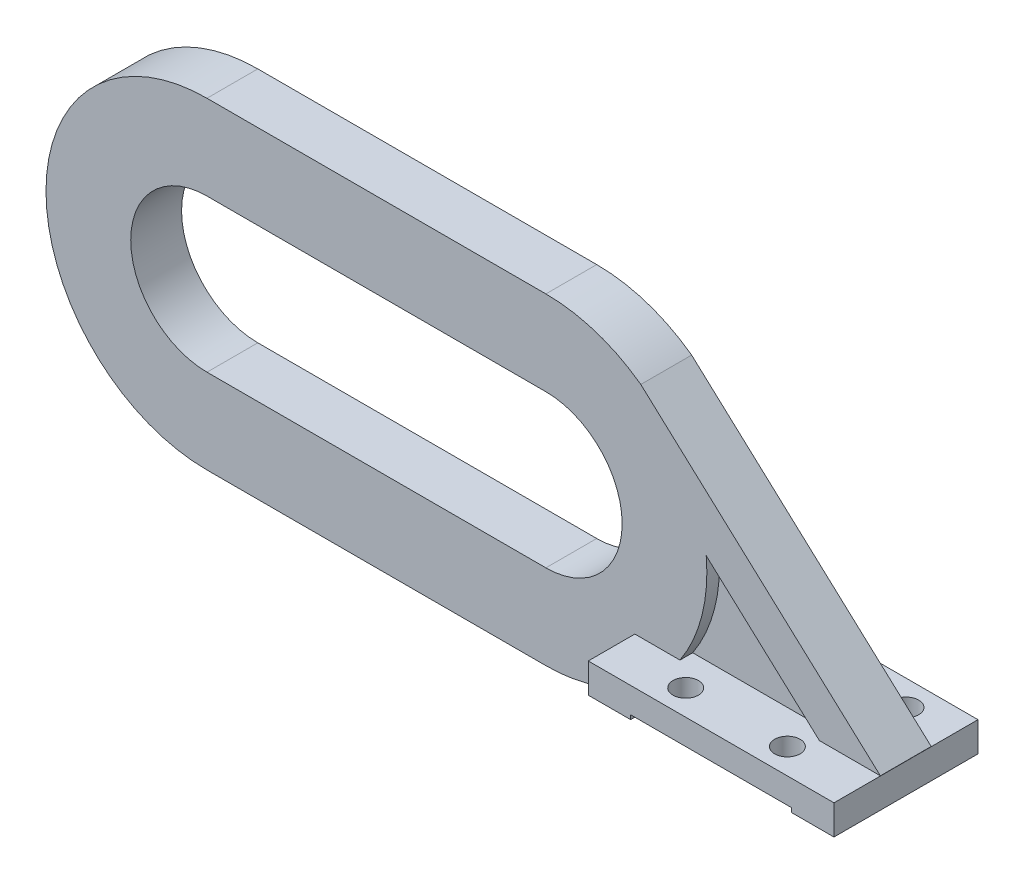
ISO-10303-21;
HEADER;
FILE_DESCRIPTION(('STEP AP214'),'2;1');
FILE_NAME('part.step','',(''),(''),'','','');
FILE_SCHEMA(('AUTOMOTIVE_DESIGN { 1 0 10303 214 1 1 1 1 }'));
ENDSEC;
DATA;
#1=APPLICATION_CONTEXT('core data for automotive mechanical design processes');
#2=APPLICATION_PROTOCOL_DEFINITION('international standard','automotive_design',2000,#1);
#3=PRODUCT_CONTEXT('',#1,'mechanical');
#4=PRODUCT('Part','Part','',(#3));
#5=PRODUCT_RELATED_PRODUCT_CATEGORY('part','',(#4));
#6=PRODUCT_DEFINITION_FORMATION('','',#4);
#7=PRODUCT_DEFINITION_CONTEXT('part definition',#1,'design');
#8=PRODUCT_DEFINITION('design','',#6,#7);
#9=PRODUCT_DEFINITION_SHAPE('','',#8);
#10=(LENGTH_UNIT() NAMED_UNIT(*) SI_UNIT(.MILLI.,.METRE.));
#11=(NAMED_UNIT(*) PLANE_ANGLE_UNIT() SI_UNIT($,.RADIAN.));
#12=(NAMED_UNIT(*) SI_UNIT($,.STERADIAN.) SOLID_ANGLE_UNIT());
#13=UNCERTAINTY_MEASURE_WITH_UNIT(LENGTH_MEASURE(1.E-05),#10,'distance_accuracy_value','');
#14=(GEOMETRIC_REPRESENTATION_CONTEXT(3) GLOBAL_UNCERTAINTY_ASSIGNED_CONTEXT((#13)) GLOBAL_UNIT_ASSIGNED_CONTEXT((#10,
#11,#12)) REPRESENTATION_CONTEXT('',''));
#15=CARTESIAN_POINT('',(0.,0.,0.));
#16=DIRECTION('',(0.,0.,1.));
#17=DIRECTION('',(1.,0.,0.));
#18=AXIS2_PLACEMENT_3D('',#15,#16,#17);
#19=CARTESIAN_POINT('',(-25.,13.5170465078334,3.));
#20=DIRECTION('',(0.,0.,-1.));
#21=DIRECTION('',(-1.,0.,0.));
#22=AXIS2_PLACEMENT_3D('',#19,#20,#21);
#23=CYLINDRICAL_SURFACE('',#22,19.);
#24=CARTESIAN_POINT('',(-25.,13.5170465078334,-1.5));
#25=DIRECTION('',(0.,0.,1.));
#26=DIRECTION('',(1.,0.,0.));
#27=AXIS2_PLACEMENT_3D('',#24,#25,#26);
#28=CIRCLE('',#27,19.);
#29=CARTESIAN_POINT('',(-9.17622887071258,3.,-1.5));
#30=VERTEX_POINT('',#29);
#31=CARTESIAN_POINT('',(-6.07646993535412,15.2199880489449,-1.5));
#32=VERTEX_POINT('',#31);
#33=EDGE_CURVE('E71',#30,#32,#28,.T.);
#34=ORIENTED_EDGE('',*,*,#33,.F.);
#35=DIRECTION('',(0.,0.,-1.));
#36=VECTOR('',#35,1.);
#37=CARTESIAN_POINT('',(-9.17622887071258,3.,3.));
#38=LINE('',#37,#36);
#39=CARTESIAN_POINT('',(-9.17622887071258,3.,-3.));
#40=VERTEX_POINT('',#39);
#41=EDGE_CURVE('E262',#30,#40,#38,.T.);
#42=ORIENTED_EDGE('',*,*,#41,.T.);
#43=CARTESIAN_POINT('',(-25.,13.5170465078334,-3.));
#44=DIRECTION('',(0.,0.,1.));
#45=DIRECTION('',(1.,0.,0.));
#46=AXIS2_PLACEMENT_3D('',#43,#44,#45);
#47=CIRCLE('',#46,19.);
#48=CARTESIAN_POINT('',(-6.07646993535412,15.2199880489449,-3.));
#49=VERTEX_POINT('',#48);
#50=EDGE_CURVE('E280',#40,#49,#47,.T.);
#51=ORIENTED_EDGE('',*,*,#50,.T.);
#52=DIRECTION('',(0.,0.,-1.));
#53=VECTOR('',#52,1.);
#54=CARTESIAN_POINT('',(-6.07646993535412,15.2199880489449,3.));
#55=LINE('',#54,#53);
#56=EDGE_CURVE('E263',#32,#49,#55,.T.);
#57=ORIENTED_EDGE('',*,*,#56,.F.);
#58=EDGE_LOOP('',(#34,#42,#51,#57));
#59=FACE_BOUND('',#58,.T.);
#60=ADVANCED_FACE('F47',(#59),#23,.T.);
#61=CARTESIAN_POINT('',(4.81172024055241,5.26029532035882,3.));
#62=DIRECTION('',(-0.674945472603317,-0.737867609407192,0.));
#63=DIRECTION('',(0.737867609407192,-0.674945472603317,0.));
#64=AXIS2_PLACEMENT_3D('',#61,#62,#63);
#65=PLANE('',#64);
#66=DIRECTION('',(0.,0.,-1.));
#67=VECTOR('',#66,1.);
#68=CARTESIAN_POINT('',(7.28273274791036,3.,3.));
#69=LINE('',#68,#67);
#70=CARTESIAN_POINT('',(7.28273274791036,3.,-1.5));
#71=VERTEX_POINT('',#70);
#72=CARTESIAN_POINT('',(7.28273274791036,3.,-3.));
#73=VERTEX_POINT('',#72);
#74=EDGE_CURVE('E430',#71,#73,#69,.T.);
#75=ORIENTED_EDGE('',*,*,#74,.F.);
#76=DIRECTION('',(-0.737867609407192,0.674945472603318,0.));
#77=VECTOR('',#76,1.);
#78=CARTESIAN_POINT('',(4.81172024055241,5.26029532035882,-1.5));
#79=LINE('',#78,#77);
#80=EDGE_CURVE('E271',#71,#32,#79,.T.);
#81=ORIENTED_EDGE('',*,*,#80,.T.);
#82=ORIENTED_EDGE('',*,*,#56,.T.);
#83=DIRECTION('',(-0.737867609407192,0.674945472603318,0.));
#84=VECTOR('',#83,1.);
#85=CARTESIAN_POINT('',(4.81172024055241,5.26029532035882,-3.));
#86=LINE('',#85,#84);
#87=EDGE_CURVE('E346',#73,#49,#86,.T.);
#88=ORIENTED_EDGE('',*,*,#87,.F.);
#89=EDGE_LOOP('',(#75,#81,#82,#88));
#90=FACE_BOUND('',#89,.T.);
#91=ADVANCED_FACE('F660',(#90),#65,.T.);
#92=CARTESIAN_POINT('',(-14.5,3.,0.));
#93=DIRECTION('',(1.,0.,0.));
#94=DIRECTION('',(0.,0.,-1.));
#95=AXIS2_PLACEMENT_3D('',#92,#93,#94);
#96=PLANE('',#95);
#97=DIRECTION('',(0.,-1.,0.));
#98=VECTOR('',#97,1.);
#99=CARTESIAN_POINT('',(-14.5,0.,-3.));
#100=LINE('',#99,#98);
#101=CARTESIAN_POINT('',(-14.5,3.,-3.));
#102=VERTEX_POINT('',#101);
#103=CARTESIAN_POINT('',(-14.5,-0.5,-3.));
#104=VERTEX_POINT('',#103);
#105=EDGE_CURVE('E372',#102,#104,#100,.T.);
#106=ORIENTED_EDGE('',*,*,#105,.F.);
#107=DIRECTION('',(0.,0.,1.));
#108=VECTOR('',#107,1.);
#109=CARTESIAN_POINT('',(-14.5,3.,0.));
#110=LINE('',#109,#108);
#111=CARTESIAN_POINT('',(-14.5,3.,-8.5));
#112=VERTEX_POINT('',#111);
#113=EDGE_CURVE('E548',#112,#102,#110,.T.);
#114=ORIENTED_EDGE('',*,*,#113,.F.);
#115=DIRECTION('',(0.,-1.,0.));
#116=VECTOR('',#115,1.);
#117=CARTESIAN_POINT('',(-14.5,3.,-8.5));
#118=LINE('',#117,#116);
#119=CARTESIAN_POINT('',(-14.5,-0.5,-8.5));
#120=VERTEX_POINT('',#119);
#121=EDGE_CURVE('E584',#112,#120,#118,.T.);
#122=ORIENTED_EDGE('',*,*,#121,.T.);
#123=DIRECTION('',(0.,0.,1.));
#124=VECTOR('',#123,1.);
#125=CARTESIAN_POINT('',(-14.5,-0.5,0.));
#126=LINE('',#125,#124);
#127=EDGE_CURVE('E483',#120,#104,#126,.T.);
#128=ORIENTED_EDGE('',*,*,#127,.T.);
#129=EDGE_LOOP('',(#106,#114,#122,#128));
#130=FACE_BOUND('',#129,.T.);
#131=ADVANCED_FACE('F671',(#130),#96,.F.);
#132=CARTESIAN_POINT('',(0.,-0.5,7.5));
#133=DIRECTION('',(0.,0.,1.));
#134=DIRECTION('',(1.,0.,0.));
#135=AXIS2_PLACEMENT_3D('',#132,#133,#134);
#136=PLANE('',#135);
#137=DIRECTION('',(1.,0.,0.));
#138=VECTOR('',#137,1.);
#139=CARTESIAN_POINT('',(0.,-0.5,7.5));
#140=LINE('',#139,#138);
#141=CARTESIAN_POINT('',(9.5,-0.5,7.5));
#142=VERTEX_POINT('',#141);
#143=CARTESIAN_POINT('',(13.5,-0.5,7.5));
#144=VERTEX_POINT('',#143);
#145=EDGE_CURVE('E470',#142,#144,#140,.T.);
#146=ORIENTED_EDGE('',*,*,#145,.F.);
#147=DIRECTION('',(0.,1.,0.));
#148=VECTOR('',#147,1.);
#149=CARTESIAN_POINT('',(9.5,-0.5,7.5));
#150=LINE('',#149,#148);
#151=CARTESIAN_POINT('',(9.5,0.,7.5));
#152=VERTEX_POINT('',#151);
#153=EDGE_CURVE('E456',#142,#152,#150,.T.);
#154=ORIENTED_EDGE('',*,*,#153,.T.);
#155=DIRECTION('',(1.,0.,0.));
#156=VECTOR('',#155,1.);
#157=CARTESIAN_POINT('',(0.,0.,7.5));
#158=LINE('',#157,#156);
#159=CARTESIAN_POINT('',(13.5,0.,7.5));
#160=VERTEX_POINT('',#159);
#161=EDGE_CURVE('E505',#152,#160,#158,.T.);
#162=ORIENTED_EDGE('',*,*,#161,.T.);
#163=DIRECTION('',(0.,1.,0.));
#164=VECTOR('',#163,1.);
#165=CARTESIAN_POINT('',(13.5,-0.5,7.5));
#166=LINE('',#165,#164);
#167=EDGE_CURVE('E520',#144,#160,#166,.T.);
#168=ORIENTED_EDGE('',*,*,#167,.F.);
#169=EDGE_LOOP('',(#146,#154,#162,#168));
#170=FACE_BOUND('',#169,.T.);
#171=ADVANCED_FACE('F687',(#170),#136,.F.);
#172=CARTESIAN_POINT('',(0.,3.,-8.5));
#173=DIRECTION('',(0.,0.,-1.));
#174=DIRECTION('',(-1.,0.,0.));
#175=AXIS2_PLACEMENT_3D('',#172,#173,#174);
#176=PLANE('',#175);
#177=DIRECTION('',(0.,-1.,0.));
#178=VECTOR('',#177,1.);
#179=CARTESIAN_POINT('',(14.5,3.,-8.5));
#180=LINE('',#179,#178);
#181=CARTESIAN_POINT('',(14.5,3.,-8.5));
#182=VERTEX_POINT('',#181);
#183=CARTESIAN_POINT('',(14.5,-0.5,-8.5));
#184=VERTEX_POINT('',#183);
#185=EDGE_CURVE('E559',#182,#184,#180,.T.);
#186=ORIENTED_EDGE('',*,*,#185,.T.);
#187=DIRECTION('',(1.,0.,0.));
#188=VECTOR('',#187,1.);
#189=CARTESIAN_POINT('',(0.,-0.5,-8.5));
#190=LINE('',#189,#188);
#191=EDGE_CURVE('E478',#120,#184,#190,.T.);
#192=ORIENTED_EDGE('',*,*,#191,.F.);
#193=ORIENTED_EDGE('',*,*,#121,.F.);
#194=DIRECTION('',(1.,0.,0.));
#195=VECTOR('',#194,1.);
#196=CARTESIAN_POINT('',(0.,3.,-8.5));
#197=LINE('',#196,#195);
#198=EDGE_CURVE('E543',#112,#182,#197,.T.);
#199=ORIENTED_EDGE('',*,*,#198,.T.);
#200=EDGE_LOOP('',(#186,#192,#193,#199));
#201=FACE_BOUND('',#200,.T.);
#202=ADVANCED_FACE('F675',(#201),#176,.T.);
#203=CARTESIAN_POINT('',(-14.5,3.,3.));
#204=VERTEX_POINT('',#203);
#205=CARTESIAN_POINT('',(-14.5,3.,8.5));
#206=VERTEX_POINT('',#205);
#207=EDGE_CURVE('E547',#204,#206,#110,.T.);
#208=ORIENTED_EDGE('',*,*,#207,.F.);
#209=DIRECTION('',(0.,-1.,0.));
#210=VECTOR('',#209,1.);
#211=CARTESIAN_POINT('',(-14.5,0.,3.));
#212=LINE('',#211,#210);
#213=CARTESIAN_POINT('',(-14.5,-0.5,3.));
#214=VERTEX_POINT('',#213);
#215=EDGE_CURVE('E322',#204,#214,#212,.T.);
#216=ORIENTED_EDGE('',*,*,#215,.T.);
#217=CARTESIAN_POINT('',(-14.5,-0.5,8.5));
#218=VERTEX_POINT('',#217);
#219=EDGE_CURVE('E482',#214,#218,#126,.T.);
#220=ORIENTED_EDGE('',*,*,#219,.T.);
#221=DIRECTION('',(0.,-1.,0.));
#222=VECTOR('',#221,1.);
#223=CARTESIAN_POINT('',(-14.5,3.,8.5));
#224=LINE('',#223,#222);
#225=EDGE_CURVE('E580',#206,#218,#224,.T.);
#226=ORIENTED_EDGE('',*,*,#225,.F.);
#227=EDGE_LOOP('',(#208,#216,#220,#226));
#228=FACE_BOUND('',#227,.T.);
#229=ADVANCED_FACE('F603',(#228),#96,.F.);
#230=CARTESIAN_POINT('',(0.,3.,8.5));
#231=DIRECTION('',(0.,0.,-1.));
#232=DIRECTION('',(-1.,0.,0.));
#233=AXIS2_PLACEMENT_3D('',#230,#231,#232);
#234=PLANE('',#233);
#235=DIRECTION('',(-1.,0.,0.));
#236=VECTOR('',#235,1.);
#237=CARTESIAN_POINT('',(-9.5,0.,8.5));
#238=LINE('',#237,#236);
#239=CARTESIAN_POINT('',(9.5,0.,8.5));
#240=VERTEX_POINT('',#239);
#241=CARTESIAN_POINT('',(-9.5,0.,8.5));
#242=VERTEX_POINT('',#241);
#243=EDGE_CURVE('E439',#240,#242,#238,.T.);
#244=ORIENTED_EDGE('',*,*,#243,.F.);
#245=DIRECTION('',(0.,1.,0.));
#246=VECTOR('',#245,1.);
#247=CARTESIAN_POINT('',(9.5,0.,8.5));
#248=LINE('',#247,#246);
#249=CARTESIAN_POINT('',(9.5,-0.5,8.5));
#250=VERTEX_POINT('',#249);
#251=EDGE_CURVE('E404',#250,#240,#248,.T.);
#252=ORIENTED_EDGE('',*,*,#251,.F.);
#253=DIRECTION('',(1.,0.,0.));
#254=VECTOR('',#253,1.);
#255=CARTESIAN_POINT('',(0.,-0.5,8.5));
#256=LINE('',#255,#254);
#257=CARTESIAN_POINT('',(14.5,-0.5,8.5));
#258=VERTEX_POINT('',#257);
#259=EDGE_CURVE('E487',#250,#258,#256,.T.);
#260=ORIENTED_EDGE('',*,*,#259,.T.);
#261=DIRECTION('',(0.,-1.,0.));
#262=VECTOR('',#261,1.);
#263=CARTESIAN_POINT('',(14.5,3.,8.5));
#264=LINE('',#263,#262);
#265=CARTESIAN_POINT('',(14.5,3.,8.5));
#266=VERTEX_POINT('',#265);
#267=EDGE_CURVE('E576',#266,#258,#264,.T.);
#268=ORIENTED_EDGE('',*,*,#267,.F.);
#269=DIRECTION('',(1.,0.,0.));
#270=VECTOR('',#269,1.);
#271=CARTESIAN_POINT('',(0.,3.,8.5));
#272=LINE('',#271,#270);
#273=EDGE_CURVE('E552',#206,#266,#272,.T.);
#274=ORIENTED_EDGE('',*,*,#273,.F.);
#275=ORIENTED_EDGE('',*,*,#225,.T.);
#276=CARTESIAN_POINT('',(-9.5,-0.5,8.5));
#277=VERTEX_POINT('',#276);
#278=EDGE_CURVE('E489',#218,#277,#256,.T.);
#279=ORIENTED_EDGE('',*,*,#278,.T.);
#280=DIRECTION('',(0.,-1.,0.));
#281=VECTOR('',#280,1.);
#282=CARTESIAN_POINT('',(-9.5,0.,8.5));
#283=LINE('',#282,#281);
#284=EDGE_CURVE('E443',#242,#277,#283,.T.);
#285=ORIENTED_EDGE('',*,*,#284,.F.);
#286=EDGE_LOOP('',(#244,#252,#260,#268,#274,#275,#279,#285));
#287=FACE_BOUND('',#286,.T.);
#288=ADVANCED_FACE('F597',(#287),#234,.F.);
#289=CARTESIAN_POINT('',(-9.00000000000001,3.,-5.5));
#290=DIRECTION('',(0.,-1.,0.));
#291=DIRECTION('',(0.,0.,-1.));
#292=AXIS2_PLACEMENT_3D('',#289,#290,#291);
#293=CYLINDRICAL_SURFACE('',#292,1.5);
#294=CARTESIAN_POINT('',(-9.00000000000001,3.,-5.5));
#295=DIRECTION('',(0.,1.,0.));
#296=DIRECTION('',(0.,0.,1.));
#297=AXIS2_PLACEMENT_3D('',#294,#295,#296);
#298=CIRCLE('',#297,1.5);
#299=CARTESIAN_POINT('',(-9.00000000000001,3.,-4.));
#300=VERTEX_POINT('',#299);
#301=EDGE_CURVE('E539',#300,#300,#298,.T.);
#302=ORIENTED_EDGE('',*,*,#301,.T.);
#303=EDGE_LOOP('',(#302));
#304=FACE_BOUND('',#303,.T.);
#305=CARTESIAN_POINT('',(-9.00000000000001,0.,-5.5));
#306=DIRECTION('',(0.,1.,0.));
#307=DIRECTION('',(0.,0.,1.));
#308=AXIS2_PLACEMENT_3D('',#305,#306,#307);
#309=CIRCLE('',#308,1.5);
#310=CARTESIAN_POINT('',(-9.00000000000001,0.,-4.));
#311=VERTEX_POINT('',#310);
#312=EDGE_CURVE('E531',#311,#311,#309,.T.);
#313=ORIENTED_EDGE('',*,*,#312,.F.);
#314=EDGE_LOOP('',(#313));
#315=FACE_BOUND('',#314,.T.);
#316=ADVANCED_FACE('F998',(#304,#315),#293,.F.);
#317=CARTESIAN_POINT('',(8.99999999999999,3.,-5.5));
#318=DIRECTION('',(0.,-1.,0.));
#319=DIRECTION('',(0.,0.,-1.));
#320=AXIS2_PLACEMENT_3D('',#317,#318,#319);
#321=CYLINDRICAL_SURFACE('',#320,1.5);
#322=CARTESIAN_POINT('',(8.99999999999999,3.,-5.5));
#323=DIRECTION('',(0.,1.,0.));
#324=DIRECTION('',(0.,0.,1.));
#325=AXIS2_PLACEMENT_3D('',#322,#323,#324);
#326=CIRCLE('',#325,1.5);
#327=CARTESIAN_POINT('',(8.99999999999999,3.,-4.));
#328=VERTEX_POINT('',#327);
#329=EDGE_CURVE('E535',#328,#328,#326,.T.);
#330=ORIENTED_EDGE('',*,*,#329,.T.);
#331=EDGE_LOOP('',(#330));
#332=FACE_BOUND('',#331,.T.);
#333=CARTESIAN_POINT('',(8.99999999999999,0.,-5.5));
#334=DIRECTION('',(0.,1.,0.));
#335=DIRECTION('',(0.,0.,1.));
#336=AXIS2_PLACEMENT_3D('',#333,#334,#335);
#337=CIRCLE('',#336,1.5);
#338=CARTESIAN_POINT('',(8.99999999999999,0.,-4.));
#339=VERTEX_POINT('',#338);
#340=EDGE_CURVE('E567',#339,#339,#337,.T.);
#341=ORIENTED_EDGE('',*,*,#340,.F.);
#342=EDGE_LOOP('',(#341));
#343=FACE_BOUND('',#342,.T.);
#344=ADVANCED_FACE('F1073',(#332,#343),#321,.F.);
#345=CARTESIAN_POINT('',(-6.,3.,5.5));
#346=DIRECTION('',(0.,-1.,0.));
#347=DIRECTION('',(0.,0.,-1.));
#348=AXIS2_PLACEMENT_3D('',#345,#346,#347);
#349=CYLINDRICAL_SURFACE('',#348,1.5);
#350=CARTESIAN_POINT('',(-6.,3.,5.5));
#351=DIRECTION('',(0.,1.,0.));
#352=DIRECTION('',(0.,0.,1.));
#353=AXIS2_PLACEMENT_3D('',#350,#351,#352);
#354=CIRCLE('',#353,1.5);
#355=CARTESIAN_POINT('',(-6.,3.,7.));
#356=VERTEX_POINT('',#355);
#357=EDGE_CURVE('E530',#356,#356,#354,.T.);
#358=ORIENTED_EDGE('',*,*,#357,.T.);
#359=EDGE_LOOP('',(#358));
#360=FACE_BOUND('',#359,.T.);
#361=CARTESIAN_POINT('',(-6.,0.,5.5));
#362=DIRECTION('',(0.,1.,0.));
#363=DIRECTION('',(0.,0.,1.));
#364=AXIS2_PLACEMENT_3D('',#361,#362,#363);
#365=CIRCLE('',#364,1.5);
#366=CARTESIAN_POINT('',(-6.,0.,7.));
#367=VERTEX_POINT('',#366);
#368=EDGE_CURVE('E563',#367,#367,#365,.T.);
#369=ORIENTED_EDGE('',*,*,#368,.F.);
#370=EDGE_LOOP('',(#369));
#371=FACE_BOUND('',#370,.T.);
#372=ADVANCED_FACE('F1062',(#360,#371),#349,.F.);
#373=CARTESIAN_POINT('',(6.,3.,5.5));
#374=DIRECTION('',(0.,-1.,0.));
#375=DIRECTION('',(0.,0.,-1.));
#376=AXIS2_PLACEMENT_3D('',#373,#374,#375);
#377=CYLINDRICAL_SURFACE('',#376,1.5);
#378=CARTESIAN_POINT('',(6.,3.,5.5));
#379=DIRECTION('',(0.,1.,0.));
#380=DIRECTION('',(0.,0.,1.));
#381=AXIS2_PLACEMENT_3D('',#378,#379,#380);
#382=CIRCLE('',#381,1.5);
#383=CARTESIAN_POINT('',(6.,3.,7.));
#384=VERTEX_POINT('',#383);
#385=EDGE_CURVE('E526',#384,#384,#382,.T.);
#386=ORIENTED_EDGE('',*,*,#385,.T.);
#387=EDGE_LOOP('',(#386));
#388=FACE_BOUND('',#387,.T.);
#389=CARTESIAN_POINT('',(6.,0.,5.5));
#390=DIRECTION('',(0.,1.,0.));
#391=DIRECTION('',(0.,0.,1.));
#392=AXIS2_PLACEMENT_3D('',#389,#390,#391);
#393=CIRCLE('',#392,1.5);
#394=CARTESIAN_POINT('',(6.,0.,7.));
#395=VERTEX_POINT('',#394);
#396=EDGE_CURVE('E515',#395,#395,#393,.T.);
#397=ORIENTED_EDGE('',*,*,#396,.F.);
#398=EDGE_LOOP('',(#397));
#399=FACE_BOUND('',#398,.T.);
#400=ADVANCED_FACE('F49',(#388,#399),#377,.F.);
#401=CARTESIAN_POINT('',(14.5,3.,0.));
#402=DIRECTION('',(1.,0.,0.));
#403=DIRECTION('',(0.,0.,-1.));
#404=AXIS2_PLACEMENT_3D('',#401,#402,#403);
#405=PLANE('',#404);
#406=ORIENTED_EDGE('',*,*,#267,.T.);
#407=DIRECTION('',(0.,0.,1.));
#408=VECTOR('',#407,1.);
#409=CARTESIAN_POINT('',(14.5,-0.5,0.));
#410=LINE('',#409,#408);
#411=EDGE_CURVE('E493',#184,#258,#410,.T.);
#412=ORIENTED_EDGE('',*,*,#411,.F.);
#413=ORIENTED_EDGE('',*,*,#185,.F.);
#414=DIRECTION('',(0.,0.,1.));
#415=VECTOR('',#414,1.);
#416=CARTESIAN_POINT('',(14.5,3.,0.));
#417=LINE('',#416,#415);
#418=EDGE_CURVE('E555',#182,#266,#417,.T.);
#419=ORIENTED_EDGE('',*,*,#418,.T.);
#420=EDGE_LOOP('',(#406,#412,#413,#419));
#421=FACE_BOUND('',#420,.T.);
#422=ADVANCED_FACE('F677',(#421),#405,.T.);
#423=CARTESIAN_POINT('',(0.,3.,0.));
#424=DIRECTION('',(0.,1.,0.));
#425=DIRECTION('',(0.,0.,1.));
#426=AXIS2_PLACEMENT_3D('',#423,#424,#425);
#427=PLANE('',#426);
#428=DIRECTION('',(1.,0.,0.));
#429=VECTOR('',#428,1.);
#430=CARTESIAN_POINT('',(0.,3.,1.5));
#431=LINE('',#430,#429);
#432=CARTESIAN_POINT('',(-9.17622887071258,3.,1.5));
#433=VERTEX_POINT('',#432);
#434=CARTESIAN_POINT('',(7.28273274791036,3.,1.5));
#435=VERTEX_POINT('',#434);
#436=EDGE_CURVE('E63',#433,#435,#431,.T.);
#437=ORIENTED_EDGE('',*,*,#436,.F.);
#438=CARTESIAN_POINT('',(-9.17622887071258,3.,3.));
#439=VERTEX_POINT('',#438);
#440=EDGE_CURVE('E268',#439,#433,#38,.T.);
#441=ORIENTED_EDGE('',*,*,#440,.F.);
#442=DIRECTION('',(1.,0.,0.));
#443=VECTOR('',#442,1.);
#444=CARTESIAN_POINT('',(0.,3.,3.));
#445=LINE('',#444,#443);
#446=EDGE_CURVE('E292',#204,#439,#445,.T.);
#447=ORIENTED_EDGE('',*,*,#446,.F.);
#448=ORIENTED_EDGE('',*,*,#207,.T.);
#449=ORIENTED_EDGE('',*,*,#273,.T.);
#450=ORIENTED_EDGE('',*,*,#418,.F.);
#451=ORIENTED_EDGE('',*,*,#198,.F.);
#452=ORIENTED_EDGE('',*,*,#113,.T.);
#453=DIRECTION('',(1.,0.,0.));
#454=VECTOR('',#453,1.);
#455=CARTESIAN_POINT('',(0.,3.,-3.));
#456=LINE('',#455,#454);
#457=EDGE_CURVE('E275',#102,#40,#456,.T.);
#458=ORIENTED_EDGE('',*,*,#457,.T.);
#459=ORIENTED_EDGE('',*,*,#41,.F.);
#460=DIRECTION('',(1.,0.,0.));
#461=VECTOR('',#460,1.);
#462=CARTESIAN_POINT('',(0.,3.,-1.5));
#463=LINE('',#462,#461);
#464=EDGE_CURVE('E286',#30,#71,#463,.T.);
#465=ORIENTED_EDGE('',*,*,#464,.T.);
#466=ORIENTED_EDGE('',*,*,#74,.T.);
#467=DIRECTION('',(1.,0.,0.));
#468=VECTOR('',#467,1.);
#469=CARTESIAN_POINT('',(0.,3.,-3.));
#470=LINE('',#469,#468);
#471=CARTESIAN_POINT('',(14.476431662807,3.,-3.));
#472=VERTEX_POINT('',#471);
#473=EDGE_CURVE('E350',#73,#472,#470,.T.);
#474=ORIENTED_EDGE('',*,*,#473,.T.);
#475=DIRECTION('',(0.,0.,-1.));
#476=VECTOR('',#475,1.);
#477=CARTESIAN_POINT('',(14.476431662807,3.,3.));
#478=LINE('',#477,#476);
#479=CARTESIAN_POINT('',(14.476431662807,3.,3.));
#480=VERTEX_POINT('',#479);
#481=EDGE_CURVE('E426',#480,#472,#478,.T.);
#482=ORIENTED_EDGE('',*,*,#481,.F.);
#483=DIRECTION('',(1.,0.,0.));
#484=VECTOR('',#483,1.);
#485=CARTESIAN_POINT('',(0.,3.,3.));
#486=LINE('',#485,#484);
#487=CARTESIAN_POINT('',(7.28273274791036,3.,3.));
#488=VERTEX_POINT('',#487);
#489=EDGE_CURVE('E302',#488,#480,#486,.T.);
#490=ORIENTED_EDGE('',*,*,#489,.F.);
#491=EDGE_CURVE('E431',#488,#435,#69,.T.);
#492=ORIENTED_EDGE('',*,*,#491,.T.);
#493=EDGE_LOOP('',(#437,#441,#447,#448,#449,#450,#451,#452,#458,#459,#465,#466,#474,#482,#490,#492));
#494=FACE_BOUND('',#493,.T.);
#495=ORIENTED_EDGE('',*,*,#385,.F.);
#496=EDGE_LOOP('',(#495));
#497=FACE_BOUND('',#496,.T.);
#498=ORIENTED_EDGE('',*,*,#357,.F.);
#499=EDGE_LOOP('',(#498));
#500=FACE_BOUND('',#499,.T.);
#501=ORIENTED_EDGE('',*,*,#329,.F.);
#502=EDGE_LOOP('',(#501));
#503=FACE_BOUND('',#502,.T.);
#504=ORIENTED_EDGE('',*,*,#301,.F.);
#505=EDGE_LOOP('',(#504));
#506=FACE_BOUND('',#505,.T.);
#507=ADVANCED_FACE('F665',(#494,#497,#500,#503,#506),#427,.T.);
#508=CARTESIAN_POINT('',(0.,0.,0.));
#509=DIRECTION('',(0.,1.,0.));
#510=DIRECTION('',(0.,0.,1.));
#511=AXIS2_PLACEMENT_3D('',#508,#509,#510);
#512=PLANE('',#511);
#513=DIRECTION('',(0.,0.,1.));
#514=VECTOR('',#513,1.);
#515=CARTESIAN_POINT('',(-9.5,0.,2.5));
#516=LINE('',#515,#514);
#517=CARTESIAN_POINT('',(-9.5,0.,7.5));
#518=VERTEX_POINT('',#517);
#519=EDGE_CURVE('E447',#518,#242,#516,.T.);
#520=ORIENTED_EDGE('',*,*,#519,.F.);
#521=CARTESIAN_POINT('',(-13.5,0.,7.5));
#522=VERTEX_POINT('',#521);
#523=EDGE_CURVE('E506',#522,#518,#158,.T.);
#524=ORIENTED_EDGE('',*,*,#523,.F.);
#525=DIRECTION('',(0.,0.,1.));
#526=VECTOR('',#525,1.);
#527=CARTESIAN_POINT('',(-13.5,0.,0.));
#528=LINE('',#527,#526);
#529=CARTESIAN_POINT('',(-13.5,0.,-7.5));
#530=VERTEX_POINT('',#529);
#531=EDGE_CURVE('E466',#530,#522,#528,.T.);
#532=ORIENTED_EDGE('',*,*,#531,.F.);
#533=DIRECTION('',(1.,0.,0.));
#534=VECTOR('',#533,1.);
#535=CARTESIAN_POINT('',(0.,0.,-7.5));
#536=LINE('',#535,#534);
#537=CARTESIAN_POINT('',(13.5,0.,-7.5));
#538=VERTEX_POINT('',#537);
#539=EDGE_CURVE('E460',#530,#538,#536,.T.);
#540=ORIENTED_EDGE('',*,*,#539,.T.);
#541=DIRECTION('',(0.,0.,1.));
#542=VECTOR('',#541,1.);
#543=CARTESIAN_POINT('',(13.5,0.,0.));
#544=LINE('',#543,#542);
#545=EDGE_CURVE('E501',#538,#160,#544,.T.);
#546=ORIENTED_EDGE('',*,*,#545,.T.);
#547=ORIENTED_EDGE('',*,*,#161,.F.);
#548=DIRECTION('',(0.,0.,1.));
#549=VECTOR('',#548,1.);
#550=CARTESIAN_POINT('',(9.5,0.,2.5));
#551=LINE('',#550,#549);
#552=EDGE_CURVE('E446',#152,#240,#551,.T.);
#553=ORIENTED_EDGE('',*,*,#552,.T.);
#554=ORIENTED_EDGE('',*,*,#243,.T.);
#555=EDGE_LOOP('',(#520,#524,#532,#540,#546,#547,#553,#554));
#556=FACE_BOUND('',#555,.T.);
#557=ORIENTED_EDGE('',*,*,#340,.T.);
#558=EDGE_LOOP('',(#557));
#559=FACE_BOUND('',#558,.T.);
#560=ORIENTED_EDGE('',*,*,#312,.T.);
#561=EDGE_LOOP('',(#560));
#562=FACE_BOUND('',#561,.T.);
#563=ORIENTED_EDGE('',*,*,#368,.T.);
#564=EDGE_LOOP('',(#563));
#565=FACE_BOUND('',#564,.T.);
#566=ORIENTED_EDGE('',*,*,#396,.T.);
#567=EDGE_LOOP('',(#566));
#568=FACE_BOUND('',#567,.T.);
#569=ADVANCED_FACE('F981',(#556,#559,#562,#565,#568),#512,.F.);
#570=CARTESIAN_POINT('',(0.,-0.5,-7.5));
#571=DIRECTION('',(0.,0.,1.));
#572=DIRECTION('',(1.,0.,0.));
#573=AXIS2_PLACEMENT_3D('',#570,#571,#572);
#574=PLANE('',#573);
#575=ORIENTED_EDGE('',*,*,#539,.F.);
#576=DIRECTION('',(0.,1.,0.));
#577=VECTOR('',#576,1.);
#578=CARTESIAN_POINT('',(-13.5,-0.5,-7.5));
#579=LINE('',#578,#577);
#580=CARTESIAN_POINT('',(-13.5,-0.5,-7.5));
#581=VERTEX_POINT('',#580);
#582=EDGE_CURVE('E512',#581,#530,#579,.T.);
#583=ORIENTED_EDGE('',*,*,#582,.F.);
#584=DIRECTION('',(1.,0.,0.));
#585=VECTOR('',#584,1.);
#586=CARTESIAN_POINT('',(0.,-0.5,-7.5));
#587=LINE('',#586,#585);
#588=CARTESIAN_POINT('',(13.5,-0.5,-7.5));
#589=VERTEX_POINT('',#588);
#590=EDGE_CURVE('E461',#581,#589,#587,.T.);
#591=ORIENTED_EDGE('',*,*,#590,.T.);
#592=DIRECTION('',(0.,1.,0.));
#593=VECTOR('',#592,1.);
#594=CARTESIAN_POINT('',(13.5,-0.5,-7.5));
#595=LINE('',#594,#593);
#596=EDGE_CURVE('E497',#589,#538,#595,.T.);
#597=ORIENTED_EDGE('',*,*,#596,.T.);
#598=EDGE_LOOP('',(#575,#583,#591,#597));
#599=FACE_BOUND('',#598,.T.);
#600=ADVANCED_FACE('F986',(#599),#574,.T.);
#601=CARTESIAN_POINT('',(-13.5,-0.5,0.));
#602=DIRECTION('',(-1.,0.,0.));
#603=DIRECTION('',(0.,0.,1.));
#604=AXIS2_PLACEMENT_3D('',#601,#602,#603);
#605=PLANE('',#604);
#606=ORIENTED_EDGE('',*,*,#531,.T.);
#607=DIRECTION('',(0.,1.,0.));
#608=VECTOR('',#607,1.);
#609=CARTESIAN_POINT('',(-13.5,-0.5,7.5));
#610=LINE('',#609,#608);
#611=CARTESIAN_POINT('',(-13.5,-0.5,7.5));
#612=VERTEX_POINT('',#611);
#613=EDGE_CURVE('E516',#612,#522,#610,.T.);
#614=ORIENTED_EDGE('',*,*,#613,.F.);
#615=DIRECTION('',(0.,0.,1.));
#616=VECTOR('',#615,1.);
#617=CARTESIAN_POINT('',(-13.5,-0.5,0.));
#618=LINE('',#617,#616);
#619=EDGE_CURVE('E475',#581,#612,#618,.T.);
#620=ORIENTED_EDGE('',*,*,#619,.F.);
#621=ORIENTED_EDGE('',*,*,#582,.T.);
#622=EDGE_LOOP('',(#606,#614,#620,#621));
#623=FACE_BOUND('',#622,.T.);
#624=ADVANCED_FACE('F972',(#623),#605,.F.);
#625=ORIENTED_EDGE('',*,*,#523,.T.);
#626=DIRECTION('',(0.,-1.,0.));
#627=VECTOR('',#626,1.);
#628=CARTESIAN_POINT('',(-9.5,-0.5,7.5));
#629=LINE('',#628,#627);
#630=CARTESIAN_POINT('',(-9.5,-0.5,7.5));
#631=VERTEX_POINT('',#630);
#632=EDGE_CURVE('E450',#518,#631,#629,.T.);
#633=ORIENTED_EDGE('',*,*,#632,.T.);
#634=EDGE_CURVE('E471',#612,#631,#140,.T.);
#635=ORIENTED_EDGE('',*,*,#634,.F.);
#636=ORIENTED_EDGE('',*,*,#613,.T.);
#637=EDGE_LOOP('',(#625,#633,#635,#636));
#638=FACE_BOUND('',#637,.T.);
#639=ADVANCED_FACE('F966',(#638),#136,.F.);
#640=CARTESIAN_POINT('',(13.5,-0.5,0.));
#641=DIRECTION('',(-1.,0.,0.));
#642=DIRECTION('',(0.,0.,1.));
#643=AXIS2_PLACEMENT_3D('',#640,#641,#642);
#644=PLANE('',#643);
#645=ORIENTED_EDGE('',*,*,#545,.F.);
#646=ORIENTED_EDGE('',*,*,#596,.F.);
#647=DIRECTION('',(0.,0.,1.));
#648=VECTOR('',#647,1.);
#649=CARTESIAN_POINT('',(13.5,-0.5,0.));
#650=LINE('',#649,#648);
#651=EDGE_CURVE('E465',#589,#144,#650,.T.);
#652=ORIENTED_EDGE('',*,*,#651,.T.);
#653=ORIENTED_EDGE('',*,*,#167,.T.);
#654=EDGE_LOOP('',(#645,#646,#652,#653));
#655=FACE_BOUND('',#654,.T.);
#656=ADVANCED_FACE('F914',(#655),#644,.T.);
#657=CARTESIAN_POINT('',(0.,-0.5,0.));
#658=DIRECTION('',(0.,1.,0.));
#659=DIRECTION('',(0.,0.,1.));
#660=AXIS2_PLACEMENT_3D('',#657,#658,#659);
#661=PLANE('',#660);
#662=ORIENTED_EDGE('',*,*,#259,.F.);
#663=DIRECTION('',(0.,0.,-1.));
#664=VECTOR('',#663,1.);
#665=CARTESIAN_POINT('',(9.5,-0.5,0.));
#666=LINE('',#665,#664);
#667=EDGE_CURVE('E11',#250,#142,#666,.T.);
#668=ORIENTED_EDGE('',*,*,#667,.T.);
#669=ORIENTED_EDGE('',*,*,#145,.T.);
#670=ORIENTED_EDGE('',*,*,#651,.F.);
#671=ORIENTED_EDGE('',*,*,#590,.F.);
#672=ORIENTED_EDGE('',*,*,#619,.T.);
#673=ORIENTED_EDGE('',*,*,#634,.T.);
#674=DIRECTION('',(0.,0.,1.));
#675=VECTOR('',#674,1.);
#676=CARTESIAN_POINT('',(-9.5,-0.5,0.));
#677=LINE('',#676,#675);
#678=EDGE_CURVE('E56',#631,#277,#677,.T.);
#679=ORIENTED_EDGE('',*,*,#678,.T.);
#680=ORIENTED_EDGE('',*,*,#278,.F.);
#681=ORIENTED_EDGE('',*,*,#219,.F.);
#682=EDGE_CURVE('E488',#104,#214,#126,.T.);
#683=ORIENTED_EDGE('',*,*,#682,.F.);
#684=ORIENTED_EDGE('',*,*,#127,.F.);
#685=ORIENTED_EDGE('',*,*,#191,.T.);
#686=ORIENTED_EDGE('',*,*,#411,.T.);
#687=EDGE_LOOP('',(#662,#668,#669,#670,#671,#672,#673,#679,#680,#681,#683,#684,#685,#686));
#688=FACE_BOUND('',#687,.T.);
#689=ADVANCED_FACE('F591',(#688),#661,.F.);
#690=CARTESIAN_POINT('',(9.5,0.,2.5));
#691=DIRECTION('',(1.,0.,0.));
#692=DIRECTION('',(0.,0.,-1.));
#693=AXIS2_PLACEMENT_3D('',#690,#691,#692);
#694=PLANE('',#693);
#695=ORIENTED_EDGE('',*,*,#667,.F.);
#696=ORIENTED_EDGE('',*,*,#251,.T.);
#697=ORIENTED_EDGE('',*,*,#552,.F.);
#698=ORIENTED_EDGE('',*,*,#153,.F.);
#699=EDGE_LOOP('',(#695,#696,#697,#698));
#700=FACE_BOUND('',#699,.T.);
#701=ADVANCED_FACE('F913',(#700),#694,.F.);
#702=CARTESIAN_POINT('',(-9.5,0.,2.5));
#703=DIRECTION('',(-1.,0.,0.));
#704=DIRECTION('',(0.,0.,1.));
#705=AXIS2_PLACEMENT_3D('',#702,#703,#704);
#706=PLANE('',#705);
#707=ORIENTED_EDGE('',*,*,#519,.T.);
#708=ORIENTED_EDGE('',*,*,#284,.T.);
#709=ORIENTED_EDGE('',*,*,#678,.F.);
#710=ORIENTED_EDGE('',*,*,#632,.F.);
#711=EDGE_LOOP('',(#707,#708,#709,#710));
#712=FACE_BOUND('',#711,.T.);
#713=ADVANCED_FACE('F734',(#712),#706,.F.);
#714=CARTESIAN_POINT('',(-14.5,0.,3.));
#715=DIRECTION('',(1.,0.,0.));
#716=DIRECTION('',(0.,1.,0.));
#717=AXIS2_PLACEMENT_3D('',#714,#715,#716);
#718=PLANE('',#717);
#719=ORIENTED_EDGE('',*,*,#682,.T.);
#720=CARTESIAN_POINT('',(-14.5,-2.31804111427975,3.));
#721=VERTEX_POINT('',#720);
#722=EDGE_CURVE('E327',#214,#721,#212,.T.);
#723=ORIENTED_EDGE('',*,*,#722,.T.);
#724=DIRECTION('',(0.,0.,-1.));
#725=VECTOR('',#724,1.);
#726=CARTESIAN_POINT('',(-14.5,-2.31804111427975,3.));
#727=LINE('',#726,#725);
#728=CARTESIAN_POINT('',(-14.5,-2.31804111427975,-3.));
#729=VERTEX_POINT('',#728);
#730=EDGE_CURVE('E341',#721,#729,#727,.T.);
#731=ORIENTED_EDGE('',*,*,#730,.T.);
#732=EDGE_CURVE('E377',#104,#729,#100,.T.);
#733=ORIENTED_EDGE('',*,*,#732,.F.);
#734=EDGE_LOOP('',(#719,#723,#731,#733));
#735=FACE_BOUND('',#734,.T.);
#736=ADVANCED_FACE('F611',(#735),#718,.T.);
#737=CARTESIAN_POINT('',(-65.,13.5170465078334,3.));
#738=DIRECTION('',(0.,0.,-1.));
#739=DIRECTION('',(-1.,0.,0.));
#740=AXIS2_PLACEMENT_3D('',#737,#738,#739);
#741=CYLINDRICAL_SURFACE('',#740,9.);
#742=CARTESIAN_POINT('',(-65.,13.5170465078334,-3.));
#743=DIRECTION('',(0.,0.,1.));
#744=DIRECTION('',(1.,0.,0.));
#745=AXIS2_PLACEMENT_3D('',#742,#743,#744);
#746=CIRCLE('',#745,9.);
#747=CARTESIAN_POINT('',(-65.,22.5170465078334,-3.));
#748=VERTEX_POINT('',#747);
#749=CARTESIAN_POINT('',(-65.,4.51704650783336,-3.));
#750=VERTEX_POINT('',#749);
#751=EDGE_CURVE('E376',#748,#750,#746,.T.);
#752=ORIENTED_EDGE('',*,*,#751,.F.);
#753=DIRECTION('',(0.,0.,-1.));
#754=VECTOR('',#753,1.);
#755=CARTESIAN_POINT('',(-65.,22.5170465078334,3.));
#756=LINE('',#755,#754);
#757=CARTESIAN_POINT('',(-65.,22.5170465078334,3.));
#758=VERTEX_POINT('',#757);
#759=EDGE_CURVE('E401',#758,#748,#756,.T.);
#760=ORIENTED_EDGE('',*,*,#759,.F.);
#761=CARTESIAN_POINT('',(-65.,13.5170465078334,3.));
#762=DIRECTION('',(0.,0.,1.));
#763=DIRECTION('',(1.,0.,0.));
#764=AXIS2_PLACEMENT_3D('',#761,#762,#763);
#765=CIRCLE('',#764,9.);
#766=CARTESIAN_POINT('',(-65.,4.51704650783336,3.));
#767=VERTEX_POINT('',#766);
#768=EDGE_CURVE('E326',#758,#767,#765,.T.);
#769=ORIENTED_EDGE('',*,*,#768,.T.);
#770=DIRECTION('',(0.,0.,-1.));
#771=VECTOR('',#770,1.);
#772=CARTESIAN_POINT('',(-65.,4.51704650783336,3.));
#773=LINE('',#772,#771);
#774=EDGE_CURVE('E392',#767,#750,#773,.T.);
#775=ORIENTED_EDGE('',*,*,#774,.T.);
#776=EDGE_LOOP('',(#752,#760,#769,#775));
#777=FACE_BOUND('',#776,.T.);
#778=ADVANCED_FACE('F722',(#777),#741,.F.);
#779=CARTESIAN_POINT('',(0.,22.5170465078334,3.));
#780=DIRECTION('',(0.,-1.,0.));
#781=DIRECTION('',(1.,0.,0.));
#782=AXIS2_PLACEMENT_3D('',#779,#780,#781);
#783=PLANE('',#782);
#784=DIRECTION('',(-1.,0.,0.));
#785=VECTOR('',#784,1.);
#786=CARTESIAN_POINT('',(0.,22.5170465078334,-3.));
#787=LINE('',#786,#785);
#788=CARTESIAN_POINT('',(-25.,22.5170465078334,-3.));
#789=VERTEX_POINT('',#788);
#790=EDGE_CURVE('E381',#789,#748,#787,.T.);
#791=ORIENTED_EDGE('',*,*,#790,.F.);
#792=DIRECTION('',(0.,0.,-1.));
#793=VECTOR('',#792,1.);
#794=CARTESIAN_POINT('',(-25.,22.5170465078334,3.));
#795=LINE('',#794,#793);
#796=CARTESIAN_POINT('',(-25.,22.5170465078334,3.));
#797=VERTEX_POINT('',#796);
#798=EDGE_CURVE('E398',#797,#789,#795,.T.);
#799=ORIENTED_EDGE('',*,*,#798,.F.);
#800=DIRECTION('',(-1.,0.,0.));
#801=VECTOR('',#800,1.);
#802=CARTESIAN_POINT('',(0.,22.5170465078334,3.));
#803=LINE('',#802,#801);
#804=EDGE_CURVE('E331',#797,#758,#803,.T.);
#805=ORIENTED_EDGE('',*,*,#804,.T.);
#806=ORIENTED_EDGE('',*,*,#759,.T.);
#807=EDGE_LOOP('',(#791,#799,#805,#806));
#808=FACE_BOUND('',#807,.T.);
#809=ADVANCED_FACE('F716',(#808),#783,.T.);
#810=CARTESIAN_POINT('',(-25.,13.5170465078334,3.));
#811=DIRECTION('',(0.,0.,-1.));
#812=DIRECTION('',(-1.,0.,0.));
#813=AXIS2_PLACEMENT_3D('',#810,#811,#812);
#814=CYLINDRICAL_SURFACE('',#813,9.);
#815=CARTESIAN_POINT('',(-25.,13.5170465078334,-3.));
#816=DIRECTION('',(0.,0.,1.));
#817=DIRECTION('',(1.,0.,0.));
#818=AXIS2_PLACEMENT_3D('',#815,#816,#817);
#819=CIRCLE('',#818,9.);
#820=CARTESIAN_POINT('',(-25.,4.51704650783336,-3.));
#821=VERTEX_POINT('',#820);
#822=EDGE_CURVE('E385',#821,#789,#819,.T.);
#823=ORIENTED_EDGE('',*,*,#822,.F.);
#824=DIRECTION('',(0.,0.,-1.));
#825=VECTOR('',#824,1.);
#826=CARTESIAN_POINT('',(-25.,4.51704650783336,3.));
#827=LINE('',#826,#825);
#828=CARTESIAN_POINT('',(-25.,4.51704650783336,3.));
#829=VERTEX_POINT('',#828);
#830=EDGE_CURVE('E395',#829,#821,#827,.T.);
#831=ORIENTED_EDGE('',*,*,#830,.F.);
#832=CARTESIAN_POINT('',(-25.,13.5170465078334,3.));
#833=DIRECTION('',(0.,0.,1.));
#834=DIRECTION('',(1.,0.,0.));
#835=AXIS2_PLACEMENT_3D('',#832,#833,#834);
#836=CIRCLE('',#835,9.);
#837=EDGE_CURVE('E335',#829,#797,#836,.T.);
#838=ORIENTED_EDGE('',*,*,#837,.T.);
#839=ORIENTED_EDGE('',*,*,#798,.T.);
#840=EDGE_LOOP('',(#823,#831,#838,#839));
#841=FACE_BOUND('',#840,.T.);
#842=ADVANCED_FACE('F711',(#841),#814,.F.);
#843=ORIENTED_EDGE('',*,*,#440,.T.);
#844=CARTESIAN_POINT('',(-25.,13.5170465078334,1.5));
#845=DIRECTION('',(0.,0.,1.));
#846=DIRECTION('',(1.,0.,0.));
#847=AXIS2_PLACEMENT_3D('',#844,#845,#846);
#848=CIRCLE('',#847,19.);
#849=CARTESIAN_POINT('',(-6.07646993535412,15.2199880489449,1.5));
#850=VERTEX_POINT('',#849);
#851=EDGE_CURVE('E266',#433,#850,#848,.T.);
#852=ORIENTED_EDGE('',*,*,#851,.T.);
#853=CARTESIAN_POINT('',(-6.07646993535412,15.2199880489449,3.));
#854=VERTEX_POINT('',#853);
#855=EDGE_CURVE('E252',#854,#850,#55,.T.);
#856=ORIENTED_EDGE('',*,*,#855,.F.);
#857=CARTESIAN_POINT('',(-25.,13.5170465078334,3.));
#858=DIRECTION('',(0.,0.,1.));
#859=DIRECTION('',(1.,0.,0.));
#860=AXIS2_PLACEMENT_3D('',#857,#858,#859);
#861=CIRCLE('',#860,19.);
#862=EDGE_CURVE('E296',#439,#854,#861,.T.);
#863=ORIENTED_EDGE('',*,*,#862,.F.);
#864=EDGE_LOOP('',(#843,#852,#856,#863));
#865=FACE_BOUND('',#864,.T.);
#866=ADVANCED_FACE('F267',(#865),#23,.T.);
#867=DIRECTION('',(-0.737867609407192,0.674945472603318,0.));
#868=VECTOR('',#867,1.);
#869=CARTESIAN_POINT('',(4.81172024055241,5.26029532035882,1.5));
#870=LINE('',#869,#868);
#871=EDGE_CURVE('E256',#435,#850,#870,.T.);
#872=ORIENTED_EDGE('',*,*,#871,.F.);
#873=ORIENTED_EDGE('',*,*,#491,.F.);
#874=DIRECTION('',(-0.737867609407192,0.674945472603318,0.));
#875=VECTOR('',#874,1.);
#876=CARTESIAN_POINT('',(4.81172024055241,5.26029532035882,3.));
#877=LINE('',#876,#875);
#878=EDGE_CURVE('E258',#488,#854,#877,.T.);
#879=ORIENTED_EDGE('',*,*,#878,.T.);
#880=ORIENTED_EDGE('',*,*,#855,.T.);
#881=EDGE_LOOP('',(#872,#873,#879,#880));
#882=FACE_BOUND('',#881,.T.);
#883=ADVANCED_FACE('F254',(#882),#65,.T.);
#884=CARTESIAN_POINT('',(8.08881978758038,8.84290414834052,3.));
#885=DIRECTION('',(-0.674945472603317,-0.737867609407192,0.));
#886=DIRECTION('',(0.737867609407192,-0.674945472603317,0.));
#887=AXIS2_PLACEMENT_3D('',#884,#885,#886);
#888=PLANE('',#887);
#889=DIRECTION('',(-0.737867609407192,0.674945472603317,0.));
#890=VECTOR('',#889,1.);
#891=CARTESIAN_POINT('',(8.08881978758038,8.84290414834052,-3.));
#892=LINE('',#891,#890);
#893=CARTESIAN_POINT('',(-13.7992962796083,28.8644969856164,-3.));
#894=VERTEX_POINT('',#893);
#895=EDGE_CURVE('E354',#472,#894,#892,.T.);
#896=ORIENTED_EDGE('',*,*,#895,.T.);
#897=DIRECTION('',(0.,0.,-1.));
#898=VECTOR('',#897,1.);
#899=CARTESIAN_POINT('',(-13.7992962796083,28.8644969856164,3.));
#900=LINE('',#899,#898);
#901=CARTESIAN_POINT('',(-13.7992962796083,28.8644969856164,3.));
#902=VERTEX_POINT('',#901);
#903=EDGE_CURVE('E422',#902,#894,#900,.T.);
#904=ORIENTED_EDGE('',*,*,#903,.F.);
#905=DIRECTION('',(-0.737867609407192,0.674945472603317,0.));
#906=VECTOR('',#905,1.);
#907=CARTESIAN_POINT('',(8.08881978758038,8.84290414834052,3.));
#908=LINE('',#907,#906);
#909=EDGE_CURVE('E305',#480,#902,#908,.T.);
#910=ORIENTED_EDGE('',*,*,#909,.F.);
#911=ORIENTED_EDGE('',*,*,#481,.T.);
#912=EDGE_LOOP('',(#896,#904,#910,#911));
#913=FACE_BOUND('',#912,.T.);
#914=ADVANCED_FACE('F653',(#913),#888,.F.);
#915=CARTESIAN_POINT('',(-25.,13.5170465078334,3.));
#916=DIRECTION('',(0.,0.,-1.));
#917=DIRECTION('',(-1.,0.,0.));
#918=AXIS2_PLACEMENT_3D('',#915,#916,#917);
#919=CYLINDRICAL_SURFACE('',#918,19.);
#920=CARTESIAN_POINT('',(-25.,13.5170465078334,-3.));
#921=DIRECTION('',(0.,0.,1.));
#922=DIRECTION('',(1.,0.,0.));
#923=AXIS2_PLACEMENT_3D('',#920,#921,#922);
#924=CIRCLE('',#923,19.);
#925=CARTESIAN_POINT('',(-25.,32.5170465078334,-3.));
#926=VERTEX_POINT('',#925);
#927=EDGE_CURVE('E357',#894,#926,#924,.T.);
#928=ORIENTED_EDGE('',*,*,#927,.T.);
#929=DIRECTION('',(0.,0.,-1.));
#930=VECTOR('',#929,1.);
#931=CARTESIAN_POINT('',(-25.,32.5170465078334,3.));
#932=LINE('',#931,#930);
#933=CARTESIAN_POINT('',(-25.,32.5170465078334,3.));
#934=VERTEX_POINT('',#933);
#935=EDGE_CURVE('E418',#934,#926,#932,.T.);
#936=ORIENTED_EDGE('',*,*,#935,.F.);
#937=CARTESIAN_POINT('',(-25.,13.5170465078334,3.));
#938=DIRECTION('',(0.,0.,1.));
#939=DIRECTION('',(1.,0.,0.));
#940=AXIS2_PLACEMENT_3D('',#937,#938,#939);
#941=CIRCLE('',#940,19.);
#942=EDGE_CURVE('E308',#902,#934,#941,.T.);
#943=ORIENTED_EDGE('',*,*,#942,.F.);
#944=ORIENTED_EDGE('',*,*,#903,.T.);
#945=EDGE_LOOP('',(#928,#936,#943,#944));
#946=FACE_BOUND('',#945,.T.);
#947=ADVANCED_FACE('F649',(#946),#919,.T.);
#948=CARTESIAN_POINT('',(0.,32.5170465078334,3.));
#949=DIRECTION('',(0.,-1.,0.));
#950=DIRECTION('',(1.,0.,0.));
#951=AXIS2_PLACEMENT_3D('',#948,#949,#950);
#952=PLANE('',#951);
#953=DIRECTION('',(-1.,0.,0.));
#954=VECTOR('',#953,1.);
#955=CARTESIAN_POINT('',(0.,32.5170465078334,-3.));
#956=LINE('',#955,#954);
#957=CARTESIAN_POINT('',(-65.,32.5170465078333,-3.));
#958=VERTEX_POINT('',#957);
#959=EDGE_CURVE('E360',#926,#958,#956,.T.);
#960=ORIENTED_EDGE('',*,*,#959,.T.);
#961=DIRECTION('',(0.,0.,-1.));
#962=VECTOR('',#961,1.);
#963=CARTESIAN_POINT('',(-65.,32.5170465078333,3.));
#964=LINE('',#963,#962);
#965=CARTESIAN_POINT('',(-65.,32.5170465078333,3.));
#966=VERTEX_POINT('',#965);
#967=EDGE_CURVE('E414',#966,#958,#964,.T.);
#968=ORIENTED_EDGE('',*,*,#967,.F.);
#969=DIRECTION('',(-1.,0.,0.));
#970=VECTOR('',#969,1.);
#971=CARTESIAN_POINT('',(0.,32.5170465078334,3.));
#972=LINE('',#971,#970);
#973=EDGE_CURVE('E311',#934,#966,#972,.T.);
#974=ORIENTED_EDGE('',*,*,#973,.F.);
#975=ORIENTED_EDGE('',*,*,#935,.T.);
#976=EDGE_LOOP('',(#960,#968,#974,#975));
#977=FACE_BOUND('',#976,.T.);
#978=ADVANCED_FACE('F644',(#977),#952,.F.);
#979=CARTESIAN_POINT('',(-65.,13.5170465078334,3.));
#980=DIRECTION('',(0.,0.,-1.));
#981=DIRECTION('',(-1.,0.,0.));
#982=AXIS2_PLACEMENT_3D('',#979,#980,#981);
#983=CYLINDRICAL_SURFACE('',#982,19.);
#984=CARTESIAN_POINT('',(-65.,13.5170465078334,-3.));
#985=DIRECTION('',(0.,0.,1.));
#986=DIRECTION('',(1.,0.,0.));
#987=AXIS2_PLACEMENT_3D('',#984,#985,#986);
#988=CIRCLE('',#987,19.);
#989=CARTESIAN_POINT('',(-65.,-5.48295349216664,-3.));
#990=VERTEX_POINT('',#989);
#991=EDGE_CURVE('E364',#958,#990,#988,.T.);
#992=ORIENTED_EDGE('',*,*,#991,.T.);
#993=DIRECTION('',(0.,0.,-1.));
#994=VECTOR('',#993,1.);
#995=CARTESIAN_POINT('',(-65.,-5.48295349216664,3.));
#996=LINE('',#995,#994);
#997=CARTESIAN_POINT('',(-65.,-5.48295349216664,3.));
#998=VERTEX_POINT('',#997);
#999=EDGE_CURVE('E411',#998,#990,#996,.T.);
#1000=ORIENTED_EDGE('',*,*,#999,.F.);
#1001=CARTESIAN_POINT('',(-65.,13.5170465078334,3.));
#1002=DIRECTION('',(0.,0.,1.));
#1003=DIRECTION('',(1.,0.,0.));
#1004=AXIS2_PLACEMENT_3D('',#1001,#1002,#1003);
#1005=CIRCLE('',#1004,19.);
#1006=EDGE_CURVE('E315',#966,#998,#1005,.T.);
#1007=ORIENTED_EDGE('',*,*,#1006,.F.);
#1008=ORIENTED_EDGE('',*,*,#967,.T.);
#1009=EDGE_LOOP('',(#992,#1000,#1007,#1008));
#1010=FACE_BOUND('',#1009,.T.);
#1011=ADVANCED_FACE('F639',(#1010),#983,.T.);
#1012=CARTESIAN_POINT('',(0.,-5.48295349216664,3.));
#1013=DIRECTION('',(0.,-1.,0.));
#1014=DIRECTION('',(0.,0.,-1.));
#1015=AXIS2_PLACEMENT_3D('',#1012,#1013,#1014);
#1016=PLANE('',#1015);
#1017=DIRECTION('',(-1.,0.,0.));
#1018=VECTOR('',#1017,1.);
#1019=CARTESIAN_POINT('',(0.,-5.48295349216664,-3.));
#1020=LINE('',#1019,#1018);
#1021=CARTESIAN_POINT('',(-25.,-5.48295349216664,-3.));
#1022=VERTEX_POINT('',#1021);
#1023=EDGE_CURVE('E368',#1022,#990,#1020,.T.);
#1024=ORIENTED_EDGE('',*,*,#1023,.F.);
#1025=DIRECTION('',(0.,0.,-1.));
#1026=VECTOR('',#1025,1.);
#1027=CARTESIAN_POINT('',(-25.,-5.48295349216664,3.));
#1028=LINE('',#1027,#1026);
#1029=CARTESIAN_POINT('',(-25.,-5.48295349216664,3.));
#1030=VERTEX_POINT('',#1029);
#1031=EDGE_CURVE('E408',#1030,#1022,#1028,.T.);
#1032=ORIENTED_EDGE('',*,*,#1031,.F.);
#1033=DIRECTION('',(-1.,0.,0.));
#1034=VECTOR('',#1033,1.);
#1035=CARTESIAN_POINT('',(0.,-5.48295349216664,3.));
#1036=LINE('',#1035,#1034);
#1037=EDGE_CURVE('E318',#1030,#998,#1036,.T.);
#1038=ORIENTED_EDGE('',*,*,#1037,.T.);
#1039=ORIENTED_EDGE('',*,*,#999,.T.);
#1040=EDGE_LOOP('',(#1024,#1032,#1038,#1039));
#1041=FACE_BOUND('',#1040,.T.);
#1042=ADVANCED_FACE('F635',(#1041),#1016,.T.);
#1043=EDGE_CURVE('E361',#1022,#729,#924,.T.);
#1044=ORIENTED_EDGE('',*,*,#1043,.T.);
#1045=ORIENTED_EDGE('',*,*,#730,.F.);
#1046=EDGE_CURVE('E312',#1030,#721,#941,.T.);
#1047=ORIENTED_EDGE('',*,*,#1046,.F.);
#1048=ORIENTED_EDGE('',*,*,#1031,.T.);
#1049=EDGE_LOOP('',(#1044,#1045,#1047,#1048));
#1050=FACE_BOUND('',#1049,.T.);
#1051=ADVANCED_FACE('F627',(#1050),#919,.T.);
#1052=CARTESIAN_POINT('',(0.,4.51704650783336,3.));
#1053=DIRECTION('',(0.,-1.,0.));
#1054=DIRECTION('',(1.,0.,0.));
#1055=AXIS2_PLACEMENT_3D('',#1052,#1053,#1054);
#1056=PLANE('',#1055);
#1057=DIRECTION('',(-1.,0.,0.));
#1058=VECTOR('',#1057,1.);
#1059=CARTESIAN_POINT('',(0.,4.51704650783336,-3.));
#1060=LINE('',#1059,#1058);
#1061=EDGE_CURVE('E297',#821,#750,#1060,.T.);
#1062=ORIENTED_EDGE('',*,*,#1061,.T.);
#1063=ORIENTED_EDGE('',*,*,#774,.F.);
#1064=DIRECTION('',(-1.,0.,0.));
#1065=VECTOR('',#1064,1.);
#1066=CARTESIAN_POINT('',(0.,4.51704650783336,3.));
#1067=LINE('',#1066,#1065);
#1068=EDGE_CURVE('E339',#829,#767,#1067,.T.);
#1069=ORIENTED_EDGE('',*,*,#1068,.F.);
#1070=ORIENTED_EDGE('',*,*,#830,.T.);
#1071=EDGE_LOOP('',(#1062,#1063,#1069,#1070));
#1072=FACE_BOUND('',#1071,.T.);
#1073=ADVANCED_FACE('F727',(#1072),#1056,.F.);
#1074=CARTESIAN_POINT('',(0.,0.,3.));
#1075=DIRECTION('',(0.,0.,1.));
#1076=DIRECTION('',(1.,0.,0.));
#1077=AXIS2_PLACEMENT_3D('',#1074,#1075,#1076);
#1078=PLANE('',#1077);
#1079=ORIENTED_EDGE('',*,*,#446,.T.);
#1080=ORIENTED_EDGE('',*,*,#862,.T.);
#1081=ORIENTED_EDGE('',*,*,#878,.F.);
#1082=ORIENTED_EDGE('',*,*,#489,.T.);
#1083=ORIENTED_EDGE('',*,*,#909,.T.);
#1084=ORIENTED_EDGE('',*,*,#942,.T.);
#1085=ORIENTED_EDGE('',*,*,#973,.T.);
#1086=ORIENTED_EDGE('',*,*,#1006,.T.);
#1087=ORIENTED_EDGE('',*,*,#1037,.F.);
#1088=ORIENTED_EDGE('',*,*,#1046,.T.);
#1089=ORIENTED_EDGE('',*,*,#722,.F.);
#1090=ORIENTED_EDGE('',*,*,#215,.F.);
#1091=EDGE_LOOP('',(#1079,#1080,#1081,#1082,#1083,#1084,#1085,#1086,#1087,#1088,#1089,#1090));
#1092=FACE_BOUND('',#1091,.T.);
#1093=ORIENTED_EDGE('',*,*,#768,.F.);
#1094=ORIENTED_EDGE('',*,*,#804,.F.);
#1095=ORIENTED_EDGE('',*,*,#837,.F.);
#1096=ORIENTED_EDGE('',*,*,#1068,.T.);
#1097=EDGE_LOOP('',(#1093,#1094,#1095,#1096));
#1098=FACE_BOUND('',#1097,.T.);
#1099=ADVANCED_FACE('F615',(#1092,#1098),#1078,.T.);
#1100=CARTESIAN_POINT('',(0.,0.,-3.));
#1101=DIRECTION('',(0.,0.,1.));
#1102=DIRECTION('',(1.,0.,0.));
#1103=AXIS2_PLACEMENT_3D('',#1100,#1101,#1102);
#1104=PLANE('',#1103);
#1105=ORIENTED_EDGE('',*,*,#457,.F.);
#1106=ORIENTED_EDGE('',*,*,#105,.T.);
#1107=ORIENTED_EDGE('',*,*,#732,.T.);
#1108=ORIENTED_EDGE('',*,*,#1043,.F.);
#1109=ORIENTED_EDGE('',*,*,#1023,.T.);
#1110=ORIENTED_EDGE('',*,*,#991,.F.);
#1111=ORIENTED_EDGE('',*,*,#959,.F.);
#1112=ORIENTED_EDGE('',*,*,#927,.F.);
#1113=ORIENTED_EDGE('',*,*,#895,.F.);
#1114=ORIENTED_EDGE('',*,*,#473,.F.);
#1115=ORIENTED_EDGE('',*,*,#87,.T.);
#1116=ORIENTED_EDGE('',*,*,#50,.F.);
#1117=EDGE_LOOP('',(#1105,#1106,#1107,#1108,#1109,#1110,#1111,#1112,#1113,#1114,#1115,#1116));
#1118=FACE_BOUND('',#1117,.T.);
#1119=ORIENTED_EDGE('',*,*,#751,.T.);
#1120=ORIENTED_EDGE('',*,*,#1061,.F.);
#1121=ORIENTED_EDGE('',*,*,#822,.T.);
#1122=ORIENTED_EDGE('',*,*,#790,.T.);
#1123=EDGE_LOOP('',(#1119,#1120,#1121,#1122));
#1124=FACE_BOUND('',#1123,.T.);
#1125=ADVANCED_FACE('F631',(#1118,#1124),#1104,.F.);
#1126=CARTESIAN_POINT('',(0.,0.,-1.5));
#1127=DIRECTION('',(0.,0.,1.));
#1128=DIRECTION('',(1.,0.,0.));
#1129=AXIS2_PLACEMENT_3D('',#1126,#1127,#1128);
#1130=PLANE('',#1129);
#1131=ORIENTED_EDGE('',*,*,#33,.T.);
#1132=ORIENTED_EDGE('',*,*,#80,.F.);
#1133=ORIENTED_EDGE('',*,*,#464,.F.);
#1134=EDGE_LOOP('',(#1131,#1132,#1133));
#1135=FACE_BOUND('',#1134,.T.);
#1136=ADVANCED_FACE('F693',(#1135),#1130,.F.);
#1137=CARTESIAN_POINT('',(0.,0.,1.5));
#1138=DIRECTION('',(0.,0.,1.));
#1139=DIRECTION('',(1.,0.,0.));
#1140=AXIS2_PLACEMENT_3D('',#1137,#1138,#1139);
#1141=PLANE('',#1140);
#1142=ORIENTED_EDGE('',*,*,#851,.F.);
#1143=ORIENTED_EDGE('',*,*,#436,.T.);
#1144=ORIENTED_EDGE('',*,*,#871,.T.);
#1145=EDGE_LOOP('',(#1142,#1143,#1144));
#1146=FACE_BOUND('',#1145,.T.);
#1147=ADVANCED_FACE('F273',(#1146),#1141,.T.);
#1148=CLOSED_SHELL('',(#60,#91,#131,#171,#202,#229,#288,#316,#344,#372,#400,#422,#507,#569,#600,
#624,#639,#656,#689,#701,#713,#736,#778,#809,#842,#866,#883,#914,#947,#978,#1011,#1042,#1051,
#1073,#1099,#1125,#1136,#1147));
#1149=MANIFOLD_SOLID_BREP('B2',#1148);
#1150=ADVANCED_BREP_SHAPE_REPRESENTATION('',(#18,#1149),#14);
#1151=SHAPE_DEFINITION_REPRESENTATION(#9,#1150);
ENDSEC;
END-ISO-10303-21;
